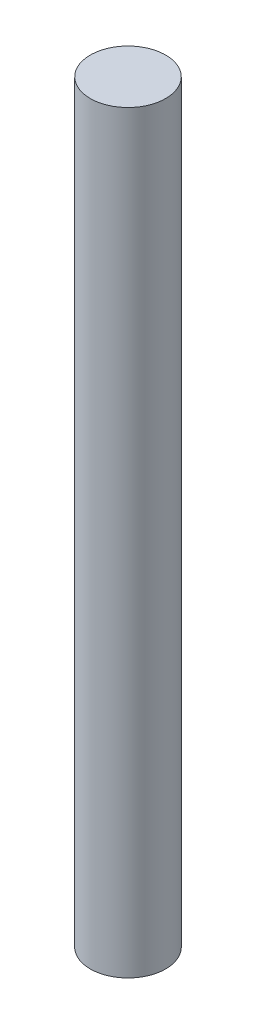
ISO-10303-21;
HEADER;
FILE_DESCRIPTION(('STEP AP214'),'2;1');
FILE_NAME('part.step','',(''),(''),'','','');
FILE_SCHEMA(('AUTOMOTIVE_DESIGN { 1 0 10303 214 1 1 1 1 }'));
ENDSEC;
DATA;
#1=APPLICATION_CONTEXT('core data for automotive mechanical design processes');
#2=APPLICATION_PROTOCOL_DEFINITION('international standard','automotive_design',2000,#1);
#3=PRODUCT_CONTEXT('',#1,'mechanical');
#4=PRODUCT('Part','Part','',(#3));
#5=PRODUCT_RELATED_PRODUCT_CATEGORY('part','',(#4));
#6=PRODUCT_DEFINITION_FORMATION('','',#4);
#7=PRODUCT_DEFINITION_CONTEXT('part definition',#1,'design');
#8=PRODUCT_DEFINITION('design','',#6,#7);
#9=PRODUCT_DEFINITION_SHAPE('','',#8);
#10=(LENGTH_UNIT() NAMED_UNIT(*) SI_UNIT(.MILLI.,.METRE.));
#11=(NAMED_UNIT(*) PLANE_ANGLE_UNIT() SI_UNIT($,.RADIAN.));
#12=(NAMED_UNIT(*) SI_UNIT($,.STERADIAN.) SOLID_ANGLE_UNIT());
#13=UNCERTAINTY_MEASURE_WITH_UNIT(LENGTH_MEASURE(1.E-05),#10,'distance_accuracy_value','');
#14=(GEOMETRIC_REPRESENTATION_CONTEXT(3) GLOBAL_UNCERTAINTY_ASSIGNED_CONTEXT((#13)) GLOBAL_UNIT_ASSIGNED_CONTEXT((#10,
#11,#12)) REPRESENTATION_CONTEXT('',''));
#15=CARTESIAN_POINT('',(0.,0.,0.));
#16=DIRECTION('',(0.,0.,1.));
#17=DIRECTION('',(1.,0.,0.));
#18=AXIS2_PLACEMENT_3D('',#15,#16,#17);
#19=CARTESIAN_POINT('',(0.,50.,0.));
#20=DIRECTION('',(0.,-1.,0.));
#21=DIRECTION('',(0.,0.,-1.));
#22=AXIS2_PLACEMENT_3D('',#19,#20,#21);
#23=CYLINDRICAL_SURFACE('',#22,2.5);
#24=CARTESIAN_POINT('',(0.,50.,0.));
#25=DIRECTION('',(0.,1.,0.));
#26=DIRECTION('',(0.,0.,1.));
#27=AXIS2_PLACEMENT_3D('',#24,#25,#26);
#28=CIRCLE('',#27,2.5);
#29=CARTESIAN_POINT('',(0.,50.,2.5));
#30=VERTEX_POINT('',#29);
#31=EDGE_CURVE('E10',#30,#30,#28,.T.);
#32=ORIENTED_EDGE('',*,*,#31,.F.);
#33=EDGE_LOOP('',(#32));
#34=FACE_BOUND('',#33,.T.);
#35=CARTESIAN_POINT('',(0.,0.,0.));
#36=DIRECTION('',(0.,1.,0.));
#37=DIRECTION('',(0.,0.,1.));
#38=AXIS2_PLACEMENT_3D('',#35,#36,#37);
#39=CIRCLE('',#38,2.5);
#40=CARTESIAN_POINT('',(0.,0.,2.5));
#41=VERTEX_POINT('',#40);
#42=EDGE_CURVE('E36',#41,#41,#39,.T.);
#43=ORIENTED_EDGE('',*,*,#42,.T.);
#44=EDGE_LOOP('',(#43));
#45=FACE_BOUND('',#44,.T.);
#46=ADVANCED_FACE('F33',(#34,#45),#23,.T.);
#47=CARTESIAN_POINT('',(0.,50.,0.));
#48=DIRECTION('',(0.,1.,0.));
#49=DIRECTION('',(0.,0.,1.));
#50=AXIS2_PLACEMENT_3D('',#47,#48,#49);
#51=PLANE('',#50);
#52=ORIENTED_EDGE('',*,*,#31,.T.);
#53=EDGE_LOOP('',(#52));
#54=FACE_BOUND('',#53,.T.);
#55=ADVANCED_FACE('F48',(#54),#51,.T.);
#56=CARTESIAN_POINT('',(0.,0.,0.));
#57=DIRECTION('',(0.,1.,0.));
#58=DIRECTION('',(0.,0.,1.));
#59=AXIS2_PLACEMENT_3D('',#56,#57,#58);
#60=PLANE('',#59);
#61=ORIENTED_EDGE('',*,*,#42,.F.);
#62=EDGE_LOOP('',(#61));
#63=FACE_BOUND('',#62,.T.);
#64=ADVANCED_FACE('F46',(#63),#60,.F.);
#65=CLOSED_SHELL('',(#46,#55,#64));
#66=MANIFOLD_SOLID_BREP('B2',#65);
#67=ADVANCED_BREP_SHAPE_REPRESENTATION('',(#18,#66),#14);
#68=SHAPE_DEFINITION_REPRESENTATION(#9,#67);
ENDSEC;
END-ISO-10303-21;
